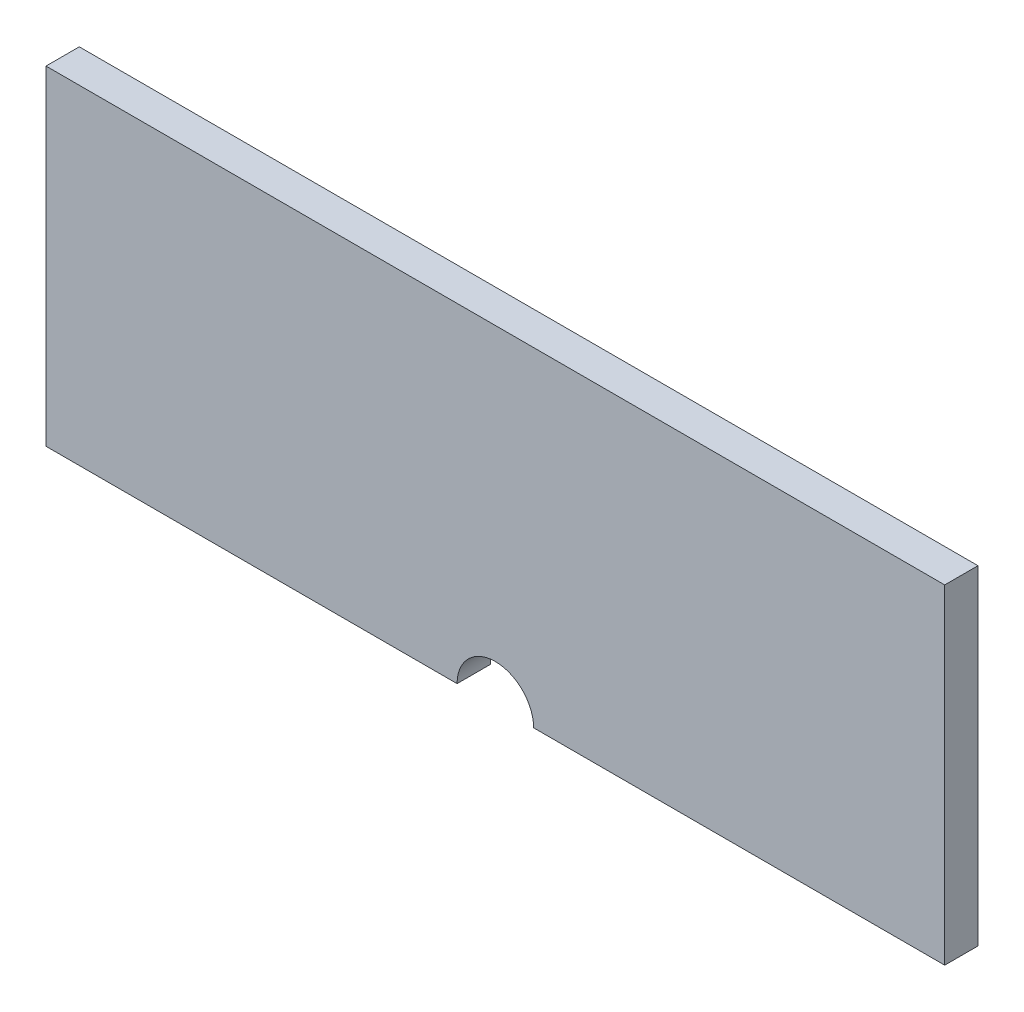
ISO-10303-21;
HEADER;
FILE_DESCRIPTION(('STEP AP214'),'2;1');
FILE_NAME('part.step','',(''),(''),'','','');
FILE_SCHEMA(('AUTOMOTIVE_DESIGN { 1 0 10303 214 1 1 1 1 }'));
ENDSEC;
DATA;
#1=APPLICATION_CONTEXT('core data for automotive mechanical design processes');
#2=APPLICATION_PROTOCOL_DEFINITION('international standard','automotive_design',2000,#1);
#3=PRODUCT_CONTEXT('',#1,'mechanical');
#4=PRODUCT('Part','Part','',(#3));
#5=PRODUCT_RELATED_PRODUCT_CATEGORY('part','',(#4));
#6=PRODUCT_DEFINITION_FORMATION('','',#4);
#7=PRODUCT_DEFINITION_CONTEXT('part definition',#1,'design');
#8=PRODUCT_DEFINITION('design','',#6,#7);
#9=PRODUCT_DEFINITION_SHAPE('','',#8);
#10=(LENGTH_UNIT() NAMED_UNIT(*) SI_UNIT(.MILLI.,.METRE.));
#11=(NAMED_UNIT(*) PLANE_ANGLE_UNIT() SI_UNIT($,.RADIAN.));
#12=(NAMED_UNIT(*) SI_UNIT($,.STERADIAN.) SOLID_ANGLE_UNIT());
#13=UNCERTAINTY_MEASURE_WITH_UNIT(LENGTH_MEASURE(1.E-05),#10,'distance_accuracy_value','');
#14=(GEOMETRIC_REPRESENTATION_CONTEXT(3) GLOBAL_UNCERTAINTY_ASSIGNED_CONTEXT((#13)) GLOBAL_UNIT_ASSIGNED_CONTEXT((#10,
#11,#12)) REPRESENTATION_CONTEXT('',''));
#15=CARTESIAN_POINT('',(0.,0.,0.));
#16=DIRECTION('',(0.,0.,1.));
#17=DIRECTION('',(1.,0.,0.));
#18=AXIS2_PLACEMENT_3D('',#15,#16,#17);
#19=CARTESIAN_POINT('',(-135.,44.47,5.));
#20=DIRECTION('',(1.,0.,0.));
#21=DIRECTION('',(0.,1.,0.));
#22=AXIS2_PLACEMENT_3D('',#19,#20,#21);
#23=PLANE('',#22);
#24=DIRECTION('',(0.,-1.,0.));
#25=VECTOR('',#24,1.);
#26=CARTESIAN_POINT('',(-135.,44.47,-5.));
#27=LINE('',#26,#25);
#28=CARTESIAN_POINT('',(-135.,44.47,-5.));
#29=VERTEX_POINT('',#28);
#30=CARTESIAN_POINT('',(-135.,-54.47,-5.));
#31=VERTEX_POINT('',#30);
#32=EDGE_CURVE('E132',#29,#31,#27,.T.);
#33=ORIENTED_EDGE('',*,*,#32,.T.);
#34=DIRECTION('',(0.,0.,-1.));
#35=VECTOR('',#34,1.);
#36=CARTESIAN_POINT('',(-135.,-54.47,5.));
#37=LINE('',#36,#35);
#38=CARTESIAN_POINT('',(-135.,-54.47,5.));
#39=VERTEX_POINT('',#38);
#40=EDGE_CURVE('E11',#39,#31,#37,.T.);
#41=ORIENTED_EDGE('',*,*,#40,.F.);
#42=DIRECTION('',(0.,-1.,0.));
#43=VECTOR('',#42,1.);
#44=CARTESIAN_POINT('',(-135.,44.47,5.));
#45=LINE('',#44,#43);
#46=CARTESIAN_POINT('',(-135.,44.47,5.));
#47=VERTEX_POINT('',#46);
#48=EDGE_CURVE('E148',#47,#39,#45,.T.);
#49=ORIENTED_EDGE('',*,*,#48,.F.);
#50=DIRECTION('',(0.,0.,-1.));
#51=VECTOR('',#50,1.);
#52=CARTESIAN_POINT('',(-135.,44.47,5.));
#53=LINE('',#52,#51);
#54=EDGE_CURVE('E128',#47,#29,#53,.T.);
#55=ORIENTED_EDGE('',*,*,#54,.T.);
#56=EDGE_LOOP('',(#33,#41,#49,#55));
#57=FACE_BOUND('',#56,.T.);
#58=ADVANCED_FACE('F43',(#57),#23,.F.);
#59=CARTESIAN_POINT('',(-11.5,-54.47,5.));
#60=DIRECTION('',(0.,1.,0.));
#61=DIRECTION('',(-1.,0.,0.));
#62=AXIS2_PLACEMENT_3D('',#59,#60,#61);
#63=PLANE('',#62);
#64=DIRECTION('',(1.,0.,0.));
#65=VECTOR('',#64,1.);
#66=CARTESIAN_POINT('',(-11.5,-54.47,-5.));
#67=LINE('',#66,#65);
#68=CARTESIAN_POINT('',(-11.5,-54.47,-5.));
#69=VERTEX_POINT('',#68);
#70=EDGE_CURVE('E136',#31,#69,#67,.T.);
#71=ORIENTED_EDGE('',*,*,#70,.T.);
#72=DIRECTION('',(0.,0.,-1.));
#73=VECTOR('',#72,1.);
#74=CARTESIAN_POINT('',(-11.5,-54.47,5.));
#75=LINE('',#74,#73);
#76=CARTESIAN_POINT('',(-11.5,-54.47,5.));
#77=VERTEX_POINT('',#76);
#78=EDGE_CURVE('E52',#77,#69,#75,.T.);
#79=ORIENTED_EDGE('',*,*,#78,.F.);
#80=DIRECTION('',(1.,0.,0.));
#81=VECTOR('',#80,1.);
#82=CARTESIAN_POINT('',(-11.5,-54.47,5.));
#83=LINE('',#82,#81);
#84=EDGE_CURVE('E97',#39,#77,#83,.T.);
#85=ORIENTED_EDGE('',*,*,#84,.F.);
#86=ORIENTED_EDGE('',*,*,#40,.T.);
#87=EDGE_LOOP('',(#71,#79,#85,#86));
#88=FACE_BOUND('',#87,.T.);
#89=ADVANCED_FACE('F176',(#88),#63,.F.);
#90=CARTESIAN_POINT('',(0.,-54.47,5.));
#91=DIRECTION('',(0.,0.,-1.));
#92=DIRECTION('',(-1.,0.,0.));
#93=AXIS2_PLACEMENT_3D('',#90,#91,#92);
#94=CYLINDRICAL_SURFACE('',#93,11.5);
#95=CARTESIAN_POINT('',(0.,-54.47,-5.));
#96=DIRECTION('',(0.,0.,-1.));
#97=DIRECTION('',(1.,0.,0.));
#98=AXIS2_PLACEMENT_3D('',#95,#96,#97);
#99=CIRCLE('',#98,11.5);
#100=CARTESIAN_POINT('',(11.5,-54.47,-5.));
#101=VERTEX_POINT('',#100);
#102=EDGE_CURVE('E139',#69,#101,#99,.T.);
#103=ORIENTED_EDGE('',*,*,#102,.T.);
#104=DIRECTION('',(0.,0.,-1.));
#105=VECTOR('',#104,1.);
#106=CARTESIAN_POINT('',(11.5,-54.47,5.));
#107=LINE('',#106,#105);
#108=CARTESIAN_POINT('',(11.5,-54.47,5.));
#109=VERTEX_POINT('',#108);
#110=EDGE_CURVE('E121',#109,#101,#107,.T.);
#111=ORIENTED_EDGE('',*,*,#110,.F.);
#112=CARTESIAN_POINT('',(0.,-54.47,5.));
#113=DIRECTION('',(0.,0.,-1.));
#114=DIRECTION('',(1.,0.,0.));
#115=AXIS2_PLACEMENT_3D('',#112,#113,#114);
#116=CIRCLE('',#115,11.5);
#117=EDGE_CURVE('E110',#77,#109,#116,.T.);
#118=ORIENTED_EDGE('',*,*,#117,.F.);
#119=ORIENTED_EDGE('',*,*,#78,.T.);
#120=EDGE_LOOP('',(#103,#111,#118,#119));
#121=FACE_BOUND('',#120,.T.);
#122=ADVANCED_FACE('F158',(#121),#94,.F.);
#123=CARTESIAN_POINT('',(135.,-54.47,5.));
#124=DIRECTION('',(0.,1.,0.));
#125=DIRECTION('',(-1.,0.,0.));
#126=AXIS2_PLACEMENT_3D('',#123,#124,#125);
#127=PLANE('',#126);
#128=DIRECTION('',(1.,0.,0.));
#129=VECTOR('',#128,1.);
#130=CARTESIAN_POINT('',(135.,-54.47,-5.));
#131=LINE('',#130,#129);
#132=CARTESIAN_POINT('',(135.,-54.47,-5.));
#133=VERTEX_POINT('',#132);
#134=EDGE_CURVE('E119',#101,#133,#131,.T.);
#135=ORIENTED_EDGE('',*,*,#134,.T.);
#136=DIRECTION('',(0.,0.,-1.));
#137=VECTOR('',#136,1.);
#138=CARTESIAN_POINT('',(135.,-54.47,5.));
#139=LINE('',#138,#137);
#140=CARTESIAN_POINT('',(135.,-54.47,5.));
#141=VERTEX_POINT('',#140);
#142=EDGE_CURVE('E116',#141,#133,#139,.T.);
#143=ORIENTED_EDGE('',*,*,#142,.F.);
#144=DIRECTION('',(1.,0.,0.));
#145=VECTOR('',#144,1.);
#146=CARTESIAN_POINT('',(135.,-54.47,5.));
#147=LINE('',#146,#145);
#148=EDGE_CURVE('E104',#109,#141,#147,.T.);
#149=ORIENTED_EDGE('',*,*,#148,.F.);
#150=ORIENTED_EDGE('',*,*,#110,.T.);
#151=EDGE_LOOP('',(#135,#143,#149,#150));
#152=FACE_BOUND('',#151,.T.);
#153=ADVANCED_FACE('F117',(#152),#127,.F.);
#154=CARTESIAN_POINT('',(135.,44.47,5.));
#155=DIRECTION('',(-1.,0.,0.));
#156=DIRECTION('',(0.,0.,1.));
#157=AXIS2_PLACEMENT_3D('',#154,#155,#156);
#158=PLANE('',#157);
#159=DIRECTION('',(0.,1.,0.));
#160=VECTOR('',#159,1.);
#161=CARTESIAN_POINT('',(135.,44.47,-5.));
#162=LINE('',#161,#160);
#163=CARTESIAN_POINT('',(135.,44.47,-5.));
#164=VERTEX_POINT('',#163);
#165=EDGE_CURVE('E83',#133,#164,#162,.T.);
#166=ORIENTED_EDGE('',*,*,#165,.T.);
#167=DIRECTION('',(0.,0.,-1.));
#168=VECTOR('',#167,1.);
#169=CARTESIAN_POINT('',(135.,44.47,5.));
#170=LINE('',#169,#168);
#171=CARTESIAN_POINT('',(135.,44.47,5.));
#172=VERTEX_POINT('',#171);
#173=EDGE_CURVE('E122',#172,#164,#170,.T.);
#174=ORIENTED_EDGE('',*,*,#173,.F.);
#175=DIRECTION('',(0.,1.,0.));
#176=VECTOR('',#175,1.);
#177=CARTESIAN_POINT('',(135.,44.47,5.));
#178=LINE('',#177,#176);
#179=EDGE_CURVE('E108',#141,#172,#178,.T.);
#180=ORIENTED_EDGE('',*,*,#179,.F.);
#181=ORIENTED_EDGE('',*,*,#142,.T.);
#182=EDGE_LOOP('',(#166,#174,#180,#181));
#183=FACE_BOUND('',#182,.T.);
#184=ADVANCED_FACE('F124',(#183),#158,.F.);
#185=CARTESIAN_POINT('',(135.,44.47,5.));
#186=DIRECTION('',(0.,-1.,0.));
#187=DIRECTION('',(1.,0.,0.));
#188=AXIS2_PLACEMENT_3D('',#185,#186,#187);
#189=PLANE('',#188);
#190=DIRECTION('',(-1.,0.,0.));
#191=VECTOR('',#190,1.);
#192=CARTESIAN_POINT('',(135.,44.47,-5.));
#193=LINE('',#192,#191);
#194=EDGE_CURVE('E89',#164,#29,#193,.T.);
#195=ORIENTED_EDGE('',*,*,#194,.T.);
#196=ORIENTED_EDGE('',*,*,#54,.F.);
#197=DIRECTION('',(-1.,0.,0.));
#198=VECTOR('',#197,1.);
#199=CARTESIAN_POINT('',(135.,44.47,5.));
#200=LINE('',#199,#198);
#201=EDGE_CURVE('E60',#172,#47,#200,.T.);
#202=ORIENTED_EDGE('',*,*,#201,.F.);
#203=ORIENTED_EDGE('',*,*,#173,.T.);
#204=EDGE_LOOP('',(#195,#196,#202,#203));
#205=FACE_BOUND('',#204,.T.);
#206=ADVANCED_FACE('F165',(#205),#189,.F.);
#207=CARTESIAN_POINT('',(0.,-54.47,5.));
#208=DIRECTION('',(0.,0.,1.));
#209=DIRECTION('',(1.,0.,0.));
#210=AXIS2_PLACEMENT_3D('',#207,#208,#209);
#211=PLANE('',#210);
#212=ORIENTED_EDGE('',*,*,#48,.T.);
#213=ORIENTED_EDGE('',*,*,#84,.T.);
#214=ORIENTED_EDGE('',*,*,#117,.T.);
#215=ORIENTED_EDGE('',*,*,#148,.T.);
#216=ORIENTED_EDGE('',*,*,#179,.T.);
#217=ORIENTED_EDGE('',*,*,#201,.T.);
#218=EDGE_LOOP('',(#212,#213,#214,#215,#216,#217));
#219=FACE_BOUND('',#218,.T.);
#220=ADVANCED_FACE('F106',(#219),#211,.T.);
#221=CARTESIAN_POINT('',(0.,-54.47,-5.));
#222=DIRECTION('',(0.,0.,1.));
#223=DIRECTION('',(1.,0.,0.));
#224=AXIS2_PLACEMENT_3D('',#221,#222,#223);
#225=PLANE('',#224);
#226=ORIENTED_EDGE('',*,*,#32,.F.);
#227=ORIENTED_EDGE('',*,*,#194,.F.);
#228=ORIENTED_EDGE('',*,*,#165,.F.);
#229=ORIENTED_EDGE('',*,*,#134,.F.);
#230=ORIENTED_EDGE('',*,*,#102,.F.);
#231=ORIENTED_EDGE('',*,*,#70,.F.);
#232=EDGE_LOOP('',(#226,#227,#228,#229,#230,#231));
#233=FACE_BOUND('',#232,.T.);
#234=ADVANCED_FACE('F161',(#233),#225,.F.);
#235=CLOSED_SHELL('',(#58,#89,#122,#153,#184,#206,#220,#234));
#236=MANIFOLD_SOLID_BREP('B2',#235);
#237=ADVANCED_BREP_SHAPE_REPRESENTATION('',(#18,#236),#14);
#238=SHAPE_DEFINITION_REPRESENTATION(#9,#237);
ENDSEC;
END-ISO-10303-21;
